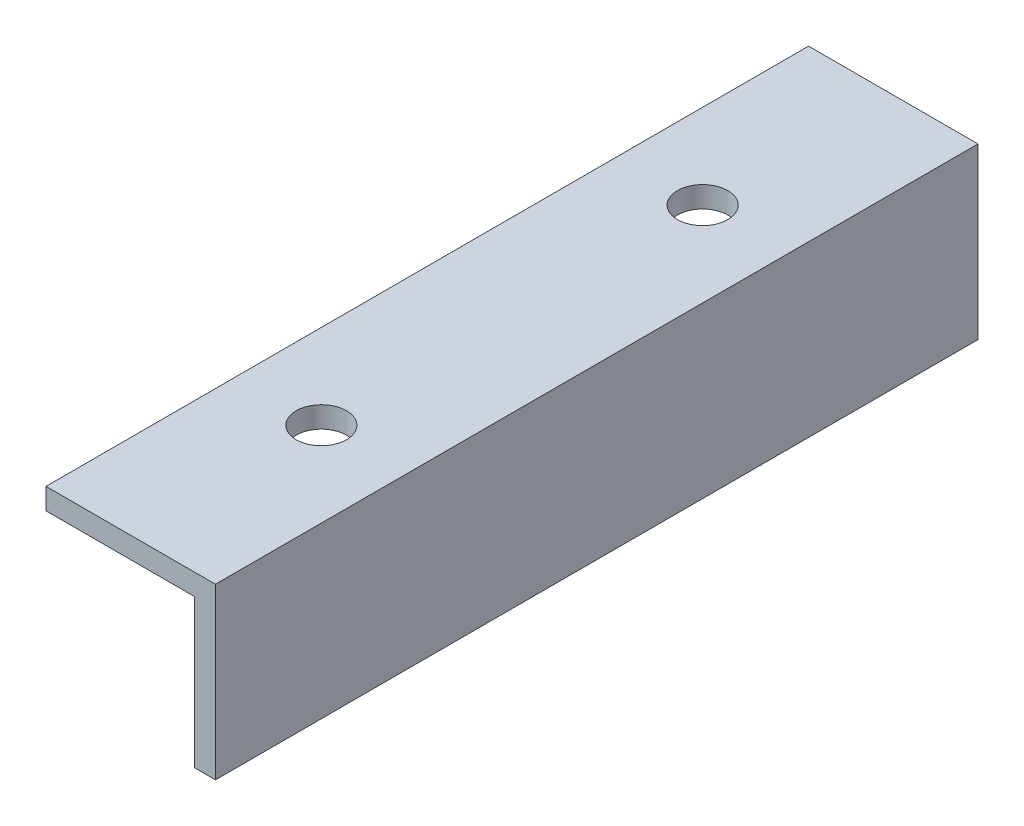
ISO-10303-21;
HEADER;
FILE_DESCRIPTION(('STEP AP214'),'2;1');
FILE_NAME('part.step','',(''),(''),'','','');
FILE_SCHEMA(('AUTOMOTIVE_DESIGN { 1 0 10303 214 1 1 1 1 }'));
ENDSEC;
DATA;
#1=APPLICATION_CONTEXT('core data for automotive mechanical design processes');
#2=APPLICATION_PROTOCOL_DEFINITION('international standard','automotive_design',2000,#1);
#3=PRODUCT_CONTEXT('',#1,'mechanical');
#4=PRODUCT('Part','Part','',(#3));
#5=PRODUCT_RELATED_PRODUCT_CATEGORY('part','',(#4));
#6=PRODUCT_DEFINITION_FORMATION('','',#4);
#7=PRODUCT_DEFINITION_CONTEXT('part definition',#1,'design');
#8=PRODUCT_DEFINITION('design','',#6,#7);
#9=PRODUCT_DEFINITION_SHAPE('','',#8);
#10=(LENGTH_UNIT() NAMED_UNIT(*) SI_UNIT(.MILLI.,.METRE.));
#11=(NAMED_UNIT(*) PLANE_ANGLE_UNIT() SI_UNIT($,.RADIAN.));
#12=(NAMED_UNIT(*) SI_UNIT($,.STERADIAN.) SOLID_ANGLE_UNIT());
#13=UNCERTAINTY_MEASURE_WITH_UNIT(LENGTH_MEASURE(1.E-05),#10,'distance_accuracy_value','');
#14=(GEOMETRIC_REPRESENTATION_CONTEXT(3) GLOBAL_UNCERTAINTY_ASSIGNED_CONTEXT((#13)) GLOBAL_UNIT_ASSIGNED_CONTEXT((#10,
#11,#12)) REPRESENTATION_CONTEXT('',''));
#15=CARTESIAN_POINT('',(0.,0.,0.));
#16=DIRECTION('',(0.,0.,1.));
#17=DIRECTION('',(1.,0.,0.));
#18=AXIS2_PLACEMENT_3D('',#15,#16,#17);
#19=CARTESIAN_POINT('',(0.,-1.5875,114.3));
#20=DIRECTION('',(1.,0.,0.));
#21=DIRECTION('',(0.,0.,-1.));
#22=AXIS2_PLACEMENT_3D('',#19,#20,#21);
#23=PLANE('',#22);
#24=DIRECTION('',(0.,-1.,0.));
#25=VECTOR('',#24,1.);
#26=CARTESIAN_POINT('',(0.,-1.5875,0.));
#27=LINE('',#26,#25);
#28=CARTESIAN_POINT('',(0.,0.,0.));
#29=VERTEX_POINT('',#28);
#30=CARTESIAN_POINT('',(0.,-3.175,0.));
#31=VERTEX_POINT('',#30);
#32=EDGE_CURVE('E128',#29,#31,#27,.T.);
#33=ORIENTED_EDGE('',*,*,#32,.T.);
#34=DIRECTION('',(0.,0.,-1.));
#35=VECTOR('',#34,1.);
#36=CARTESIAN_POINT('',(0.,-3.175,114.3));
#37=LINE('',#36,#35);
#38=CARTESIAN_POINT('',(0.,-3.175,114.3));
#39=VERTEX_POINT('',#38);
#40=EDGE_CURVE('E9',#39,#31,#37,.T.);
#41=ORIENTED_EDGE('',*,*,#40,.F.);
#42=DIRECTION('',(0.,-1.,0.));
#43=VECTOR('',#42,1.);
#44=CARTESIAN_POINT('',(0.,-1.5875,114.3));
#45=LINE('',#44,#43);
#46=CARTESIAN_POINT('',(0.,0.,114.3));
#47=VERTEX_POINT('',#46);
#48=EDGE_CURVE('E145',#47,#39,#45,.T.);
#49=ORIENTED_EDGE('',*,*,#48,.F.);
#50=DIRECTION('',(0.,0.,-1.));
#51=VECTOR('',#50,1.);
#52=CARTESIAN_POINT('',(0.,0.,114.3));
#53=LINE('',#52,#51);
#54=EDGE_CURVE('E38',#47,#29,#53,.T.);
#55=ORIENTED_EDGE('',*,*,#54,.T.);
#56=EDGE_LOOP('',(#33,#41,#49,#55));
#57=FACE_BOUND('',#56,.T.);
#58=ADVANCED_FACE('F14',(#57),#23,.F.);
#59=CARTESIAN_POINT('',(11.1125,-3.175,114.3));
#60=DIRECTION('',(0.,1.,0.));
#61=DIRECTION('',(0.,0.,1.));
#62=AXIS2_PLACEMENT_3D('',#59,#60,#61);
#63=PLANE('',#62);
#64=CARTESIAN_POINT('',(12.7,-3.175,28.575));
#65=DIRECTION('',(0.,1.,0.));
#66=DIRECTION('',(0.,0.,1.));
#67=AXIS2_PLACEMENT_3D('',#64,#65,#66);
#68=CIRCLE('',#67,3.7703125);
#69=CARTESIAN_POINT('',(12.7,-3.175,32.3453125));
#70=VERTEX_POINT('',#69);
#71=EDGE_CURVE('E17',#70,#70,#68,.F.);
#72=ORIENTED_EDGE('',*,*,#71,.F.);
#73=EDGE_LOOP('',(#72));
#74=FACE_BOUND('',#73,.T.);
#75=CARTESIAN_POINT('',(12.7,-3.175,85.725));
#76=DIRECTION('',(0.,1.,0.));
#77=DIRECTION('',(0.,0.,1.));
#78=AXIS2_PLACEMENT_3D('',#75,#76,#77);
#79=CIRCLE('',#78,3.7703125);
#80=CARTESIAN_POINT('',(12.7,-3.175,89.4953125));
#81=VERTEX_POINT('',#80);
#82=EDGE_CURVE('E132',#81,#81,#79,.F.);
#83=ORIENTED_EDGE('',*,*,#82,.F.);
#84=EDGE_LOOP('',(#83));
#85=FACE_BOUND('',#84,.T.);
#86=DIRECTION('',(1.,0.,0.));
#87=VECTOR('',#86,1.);
#88=CARTESIAN_POINT('',(11.1125,-3.175,0.));
#89=LINE('',#88,#87);
#90=CARTESIAN_POINT('',(22.225,-3.175,0.));
#91=VERTEX_POINT('',#90);
#92=EDGE_CURVE('E131',#31,#91,#89,.T.);
#93=ORIENTED_EDGE('',*,*,#92,.T.);
#94=DIRECTION('',(0.,0.,-1.));
#95=VECTOR('',#94,1.);
#96=CARTESIAN_POINT('',(22.225,-3.175,114.3));
#97=LINE('',#96,#95);
#98=CARTESIAN_POINT('',(22.225,-3.175,114.3));
#99=VERTEX_POINT('',#98);
#100=EDGE_CURVE('E24',#99,#91,#97,.T.);
#101=ORIENTED_EDGE('',*,*,#100,.F.);
#102=DIRECTION('',(1.,0.,0.));
#103=VECTOR('',#102,1.);
#104=CARTESIAN_POINT('',(11.1125,-3.175,114.3));
#105=LINE('',#104,#103);
#106=EDGE_CURVE('E80',#39,#99,#105,.T.);
#107=ORIENTED_EDGE('',*,*,#106,.F.);
#108=ORIENTED_EDGE('',*,*,#40,.T.);
#109=EDGE_LOOP('',(#93,#101,#107,#108));
#110=FACE_BOUND('',#109,.T.);
#111=ADVANCED_FACE('F224',(#74,#85,#110),#63,.F.);
#112=CARTESIAN_POINT('',(22.225,-14.2875,114.3));
#113=DIRECTION('',(1.,0.,0.));
#114=DIRECTION('',(0.,0.,-1.));
#115=AXIS2_PLACEMENT_3D('',#112,#113,#114);
#116=PLANE('',#115);
#117=DIRECTION('',(0.,-1.,0.));
#118=VECTOR('',#117,1.);
#119=CARTESIAN_POINT('',(22.225,-14.2875,0.));
#120=LINE('',#119,#118);
#121=CARTESIAN_POINT('',(22.225,-25.4,0.));
#122=VERTEX_POINT('',#121);
#123=EDGE_CURVE('E135',#91,#122,#120,.T.);
#124=ORIENTED_EDGE('',*,*,#123,.T.);
#125=DIRECTION('',(0.,0.,-1.));
#126=VECTOR('',#125,1.);
#127=CARTESIAN_POINT('',(22.225,-25.4,114.3));
#128=LINE('',#127,#126);
#129=CARTESIAN_POINT('',(22.225,-25.4,114.3));
#130=VERTEX_POINT('',#129);
#131=EDGE_CURVE('E115',#130,#122,#128,.T.);
#132=ORIENTED_EDGE('',*,*,#131,.F.);
#133=DIRECTION('',(0.,-1.,0.));
#134=VECTOR('',#133,1.);
#135=CARTESIAN_POINT('',(22.225,-14.2875,114.3));
#136=LINE('',#135,#134);
#137=EDGE_CURVE('E101',#99,#130,#136,.T.);
#138=ORIENTED_EDGE('',*,*,#137,.F.);
#139=ORIENTED_EDGE('',*,*,#100,.T.);
#140=EDGE_LOOP('',(#124,#132,#138,#139));
#141=FACE_BOUND('',#140,.T.);
#142=ADVANCED_FACE('F219',(#141),#116,.F.);
#143=CARTESIAN_POINT('',(23.8125,-25.4,114.3));
#144=DIRECTION('',(0.,1.,0.));
#145=DIRECTION('',(0.,0.,1.));
#146=AXIS2_PLACEMENT_3D('',#143,#144,#145);
#147=PLANE('',#146);
#148=DIRECTION('',(1.,0.,0.));
#149=VECTOR('',#148,1.);
#150=CARTESIAN_POINT('',(23.8125,-25.4,0.));
#151=LINE('',#150,#149);
#152=CARTESIAN_POINT('',(25.4,-25.4,0.));
#153=VERTEX_POINT('',#152);
#154=EDGE_CURVE('E111',#122,#153,#151,.T.);
#155=ORIENTED_EDGE('',*,*,#154,.T.);
#156=DIRECTION('',(0.,0.,-1.));
#157=VECTOR('',#156,1.);
#158=CARTESIAN_POINT('',(25.4,-25.4,114.3));
#159=LINE('',#158,#157);
#160=CARTESIAN_POINT('',(25.4,-25.4,114.3));
#161=VERTEX_POINT('',#160);
#162=EDGE_CURVE('E108',#161,#153,#159,.T.);
#163=ORIENTED_EDGE('',*,*,#162,.F.);
#164=DIRECTION('',(1.,0.,0.));
#165=VECTOR('',#164,1.);
#166=CARTESIAN_POINT('',(23.8125,-25.4,114.3));
#167=LINE('',#166,#165);
#168=EDGE_CURVE('E94',#130,#161,#167,.T.);
#169=ORIENTED_EDGE('',*,*,#168,.F.);
#170=ORIENTED_EDGE('',*,*,#131,.T.);
#171=EDGE_LOOP('',(#155,#163,#169,#170));
#172=FACE_BOUND('',#171,.T.);
#173=ADVANCED_FACE('F109',(#172),#147,.F.);
#174=CARTESIAN_POINT('',(25.4,-12.7,114.3));
#175=DIRECTION('',(1.,0.,0.));
#176=DIRECTION('',(0.,0.,-1.));
#177=AXIS2_PLACEMENT_3D('',#174,#175,#176);
#178=PLANE('',#177);
#179=DIRECTION('',(0.,-1.,0.));
#180=VECTOR('',#179,1.);
#181=CARTESIAN_POINT('',(25.4,-12.7,0.));
#182=LINE('',#181,#180);
#183=CARTESIAN_POINT('',(25.4,0.,0.));
#184=VERTEX_POINT('',#183);
#185=EDGE_CURVE('E139',#184,#153,#182,.T.);
#186=ORIENTED_EDGE('',*,*,#185,.F.);
#187=DIRECTION('',(0.,0.,-1.));
#188=VECTOR('',#187,1.);
#189=CARTESIAN_POINT('',(25.4,0.,114.3));
#190=LINE('',#189,#188);
#191=CARTESIAN_POINT('',(25.4,0.,114.3));
#192=VERTEX_POINT('',#191);
#193=EDGE_CURVE('E64',#192,#184,#190,.T.);
#194=ORIENTED_EDGE('',*,*,#193,.F.);
#195=DIRECTION('',(0.,-1.,0.));
#196=VECTOR('',#195,1.);
#197=CARTESIAN_POINT('',(25.4,-12.7,114.3));
#198=LINE('',#197,#196);
#199=EDGE_CURVE('E99',#192,#161,#198,.T.);
#200=ORIENTED_EDGE('',*,*,#199,.T.);
#201=ORIENTED_EDGE('',*,*,#162,.T.);
#202=EDGE_LOOP('',(#186,#194,#200,#201));
#203=FACE_BOUND('',#202,.T.);
#204=ADVANCED_FACE('F117',(#203),#178,.T.);
#205=CARTESIAN_POINT('',(12.7,0.,114.3));
#206=DIRECTION('',(0.,1.,0.));
#207=DIRECTION('',(0.,0.,1.));
#208=AXIS2_PLACEMENT_3D('',#205,#206,#207);
#209=PLANE('',#208);
#210=CARTESIAN_POINT('',(12.7,0.,28.575));
#211=DIRECTION('',(0.,1.,0.));
#212=DIRECTION('',(0.,0.,1.));
#213=AXIS2_PLACEMENT_3D('',#210,#211,#212);
#214=CIRCLE('',#213,3.7703125);
#215=CARTESIAN_POINT('',(12.7,0.,32.3453125));
#216=VERTEX_POINT('',#215);
#217=EDGE_CURVE('E169',#216,#216,#214,.T.);
#218=ORIENTED_EDGE('',*,*,#217,.F.);
#219=EDGE_LOOP('',(#218));
#220=FACE_BOUND('',#219,.T.);
#221=CARTESIAN_POINT('',(12.7,0.,85.725));
#222=DIRECTION('',(0.,1.,0.));
#223=DIRECTION('',(0.,0.,1.));
#224=AXIS2_PLACEMENT_3D('',#221,#222,#223);
#225=CIRCLE('',#224,3.7703125);
#226=CARTESIAN_POINT('',(12.7,0.,89.4953125));
#227=VERTEX_POINT('',#226);
#228=EDGE_CURVE('E155',#227,#227,#225,.T.);
#229=ORIENTED_EDGE('',*,*,#228,.F.);
#230=EDGE_LOOP('',(#229));
#231=FACE_BOUND('',#230,.T.);
#232=DIRECTION('',(1.,0.,0.));
#233=VECTOR('',#232,1.);
#234=CARTESIAN_POINT('',(12.7,0.,0.));
#235=LINE('',#234,#233);
#236=EDGE_CURVE('E141',#29,#184,#235,.T.);
#237=ORIENTED_EDGE('',*,*,#236,.F.);
#238=ORIENTED_EDGE('',*,*,#54,.F.);
#239=DIRECTION('',(1.,0.,0.));
#240=VECTOR('',#239,1.);
#241=CARTESIAN_POINT('',(12.7,0.,114.3));
#242=LINE('',#241,#240);
#243=EDGE_CURVE('E119',#47,#192,#242,.T.);
#244=ORIENTED_EDGE('',*,*,#243,.T.);
#245=ORIENTED_EDGE('',*,*,#193,.T.);
#246=EDGE_LOOP('',(#237,#238,#244,#245));
#247=FACE_BOUND('',#246,.T.);
#248=ADVANCED_FACE('F204',(#220,#231,#247),#209,.T.);
#249=CARTESIAN_POINT('',(12.7,-12.7,114.3));
#250=DIRECTION('',(0.,0.,1.));
#251=DIRECTION('',(1.,0.,0.));
#252=AXIS2_PLACEMENT_3D('',#249,#250,#251);
#253=PLANE('',#252);
#254=ORIENTED_EDGE('',*,*,#48,.T.);
#255=ORIENTED_EDGE('',*,*,#106,.T.);
#256=ORIENTED_EDGE('',*,*,#137,.T.);
#257=ORIENTED_EDGE('',*,*,#168,.T.);
#258=ORIENTED_EDGE('',*,*,#199,.F.);
#259=ORIENTED_EDGE('',*,*,#243,.F.);
#260=EDGE_LOOP('',(#254,#255,#256,#257,#258,#259));
#261=FACE_BOUND('',#260,.T.);
#262=ADVANCED_FACE('F96',(#261),#253,.T.);
#263=CARTESIAN_POINT('',(12.7,-12.7,0.));
#264=DIRECTION('',(0.,0.,1.));
#265=DIRECTION('',(1.,0.,0.));
#266=AXIS2_PLACEMENT_3D('',#263,#264,#265);
#267=PLANE('',#266);
#268=ORIENTED_EDGE('',*,*,#32,.F.);
#269=ORIENTED_EDGE('',*,*,#236,.T.);
#270=ORIENTED_EDGE('',*,*,#185,.T.);
#271=ORIENTED_EDGE('',*,*,#154,.F.);
#272=ORIENTED_EDGE('',*,*,#123,.F.);
#273=ORIENTED_EDGE('',*,*,#92,.F.);
#274=EDGE_LOOP('',(#268,#269,#270,#271,#272,#273));
#275=FACE_BOUND('',#274,.T.);
#276=ADVANCED_FACE('F187',(#275),#267,.F.);
#277=CARTESIAN_POINT('',(12.7,-120.944276528458,85.725));
#278=DIRECTION('',(0.,1.,0.));
#279=DIRECTION('',(0.,0.,1.));
#280=AXIS2_PLACEMENT_3D('',#277,#278,#279);
#281=CYLINDRICAL_SURFACE('',#280,3.7703125);
#282=ORIENTED_EDGE('',*,*,#228,.T.);
#283=EDGE_LOOP('',(#282));
#284=FACE_BOUND('',#283,.T.);
#285=ORIENTED_EDGE('',*,*,#82,.T.);
#286=EDGE_LOOP('',(#285));
#287=FACE_BOUND('',#286,.T.);
#288=ADVANCED_FACE('F192',(#284,#287),#281,.F.);
#289=CARTESIAN_POINT('',(12.7,-120.944276528458,28.575));
#290=DIRECTION('',(0.,1.,0.));
#291=DIRECTION('',(0.,0.,1.));
#292=AXIS2_PLACEMENT_3D('',#289,#290,#291);
#293=CYLINDRICAL_SURFACE('',#292,3.7703125);
#294=ORIENTED_EDGE('',*,*,#217,.T.);
#295=EDGE_LOOP('',(#294));
#296=FACE_BOUND('',#295,.T.);
#297=ORIENTED_EDGE('',*,*,#71,.T.);
#298=EDGE_LOOP('',(#297));
#299=FACE_BOUND('',#298,.T.);
#300=ADVANCED_FACE('F308',(#296,#299),#293,.F.);
#301=CLOSED_SHELL('',(#58,#111,#142,#173,#204,#248,#262,#276,#288,#300));
#302=MANIFOLD_SOLID_BREP('B1',#301);
#303=ADVANCED_BREP_SHAPE_REPRESENTATION('',(#18,#302),#14);
#304=SHAPE_DEFINITION_REPRESENTATION(#9,#303);
ENDSEC;
END-ISO-10303-21;
